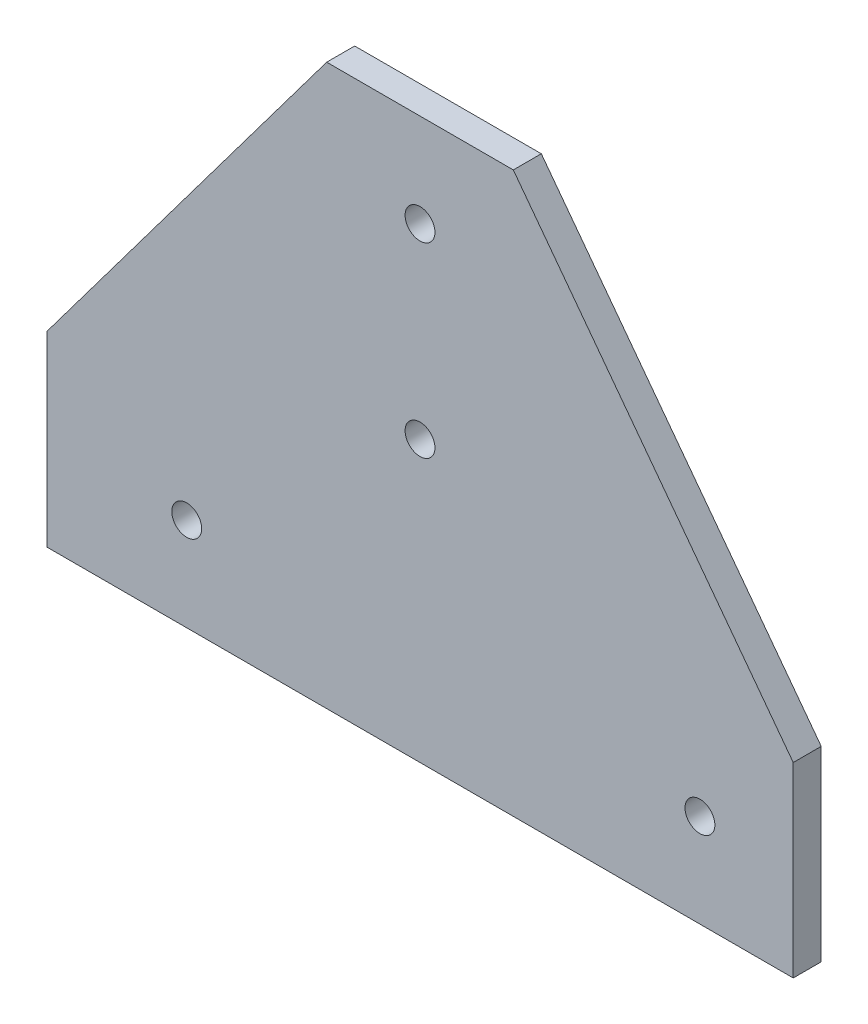
ISO-10303-21;
HEADER;
FILE_DESCRIPTION(('STEP AP214'),'2;1');
FILE_NAME('part.step','',(''),(''),'','','');
FILE_SCHEMA(('AUTOMOTIVE_DESIGN { 1 0 10303 214 1 1 1 1 }'));
ENDSEC;
DATA;
#1=APPLICATION_CONTEXT('core data for automotive mechanical design processes');
#2=APPLICATION_PROTOCOL_DEFINITION('international standard','automotive_design',2000,#1);
#3=PRODUCT_CONTEXT('',#1,'mechanical');
#4=PRODUCT('Part','Part','',(#3));
#5=PRODUCT_RELATED_PRODUCT_CATEGORY('part','',(#4));
#6=PRODUCT_DEFINITION_FORMATION('','',#4);
#7=PRODUCT_DEFINITION_CONTEXT('part definition',#1,'design');
#8=PRODUCT_DEFINITION('design','',#6,#7);
#9=PRODUCT_DEFINITION_SHAPE('','',#8);
#10=(LENGTH_UNIT() NAMED_UNIT(*) SI_UNIT(.MILLI.,.METRE.));
#11=(NAMED_UNIT(*) PLANE_ANGLE_UNIT() SI_UNIT($,.RADIAN.));
#12=(NAMED_UNIT(*) SI_UNIT($,.STERADIAN.) SOLID_ANGLE_UNIT());
#13=UNCERTAINTY_MEASURE_WITH_UNIT(LENGTH_MEASURE(1.E-05),#10,'distance_accuracy_value','');
#14=(GEOMETRIC_REPRESENTATION_CONTEXT(3) GLOBAL_UNCERTAINTY_ASSIGNED_CONTEXT((#13)) GLOBAL_UNIT_ASSIGNED_CONTEXT((#10,
#11,#12)) REPRESENTATION_CONTEXT('',''));
#15=CARTESIAN_POINT('',(0.,0.,0.));
#16=DIRECTION('',(0.,0.,1.));
#17=DIRECTION('',(1.,0.,0.));
#18=AXIS2_PLACEMENT_3D('',#15,#16,#17);
#19=CARTESIAN_POINT('',(0.,0.,3.));
#20=DIRECTION('',(0.,0.,1.));
#21=DIRECTION('',(1.,0.,0.));
#22=AXIS2_PLACEMENT_3D('',#19,#20,#21);
#23=PLANE('',#22);
#24=CARTESIAN_POINT('',(443.489921235063,10.,3.));
#25=DIRECTION('',(0.,0.,1.));
#26=DIRECTION('',(1.,0.,0.));
#27=AXIS2_PLACEMENT_3D('',#24,#25,#26);
#28=CIRCLE('',#27,1.59999999999996);
#29=CARTESIAN_POINT('',(445.089921235063,10.,3.));
#30=VERTEX_POINT('',#29);
#31=EDGE_CURVE('E191',#30,#30,#28,.T.);
#32=ORIENTED_EDGE('',*,*,#31,.F.);
#33=EDGE_LOOP('',(#32));
#34=FACE_BOUND('',#33,.T.);
#35=CARTESIAN_POINT('',(413.489921235063,50.,3.));
#36=DIRECTION('',(0.,0.,1.));
#37=DIRECTION('',(1.,0.,0.));
#38=AXIS2_PLACEMENT_3D('',#35,#36,#37);
#39=CIRCLE('',#38,1.59999999999996);
#40=CARTESIAN_POINT('',(415.089921235063,50.,3.));
#41=VERTEX_POINT('',#40);
#42=EDGE_CURVE('E124',#41,#41,#39,.T.);
#43=ORIENTED_EDGE('',*,*,#42,.F.);
#44=EDGE_LOOP('',(#43));
#45=FACE_BOUND('',#44,.T.);
#46=DIRECTION('',(1.,0.,0.));
#47=VECTOR('',#46,1.);
#48=CARTESIAN_POINT('',(373.489921235063,0.,3.));
#49=LINE('',#48,#47);
#50=CARTESIAN_POINT('',(373.489921235063,0.,3.));
#51=VERTEX_POINT('',#50);
#52=CARTESIAN_POINT('',(453.489921235063,0.,3.));
#53=VERTEX_POINT('',#52);
#54=EDGE_CURVE('E131',#51,#53,#49,.T.);
#55=ORIENTED_EDGE('',*,*,#54,.T.);
#56=DIRECTION('',(0.,1.,0.));
#57=VECTOR('',#56,1.);
#58=CARTESIAN_POINT('',(453.489921235063,0.,3.));
#59=LINE('',#58,#57);
#60=CARTESIAN_POINT('',(453.489921235063,20.,3.));
#61=VERTEX_POINT('',#60);
#62=EDGE_CURVE('E89',#53,#61,#59,.T.);
#63=ORIENTED_EDGE('',*,*,#62,.T.);
#64=DIRECTION('',(-0.599999999999999,0.800000000000001,0.));
#65=VECTOR('',#64,1.);
#66=CARTESIAN_POINT('',(453.489921235063,20.,3.));
#67=LINE('',#66,#65);
#68=CARTESIAN_POINT('',(423.489921235063,60.,3.));
#69=VERTEX_POINT('',#68);
#70=EDGE_CURVE('E102',#61,#69,#67,.T.);
#71=ORIENTED_EDGE('',*,*,#70,.T.);
#72=DIRECTION('',(-1.,0.,0.));
#73=VECTOR('',#72,1.);
#74=CARTESIAN_POINT('',(423.489921235063,60.,3.));
#75=LINE('',#74,#73);
#76=CARTESIAN_POINT('',(403.489921235063,60.,3.));
#77=VERTEX_POINT('',#76);
#78=EDGE_CURVE('E96',#69,#77,#75,.T.);
#79=ORIENTED_EDGE('',*,*,#78,.T.);
#80=DIRECTION('',(-0.6,-0.8,0.));
#81=VECTOR('',#80,1.);
#82=CARTESIAN_POINT('',(403.489921235063,60.,3.));
#83=LINE('',#82,#81);
#84=CARTESIAN_POINT('',(373.489921235063,20.,3.));
#85=VERTEX_POINT('',#84);
#86=EDGE_CURVE('E100',#77,#85,#83,.T.);
#87=ORIENTED_EDGE('',*,*,#86,.T.);
#88=DIRECTION('',(0.,-1.,0.));
#89=VECTOR('',#88,1.);
#90=CARTESIAN_POINT('',(373.489921235063,20.,3.));
#91=LINE('',#90,#89);
#92=EDGE_CURVE('E52',#85,#51,#91,.T.);
#93=ORIENTED_EDGE('',*,*,#92,.T.);
#94=EDGE_LOOP('',(#55,#63,#71,#79,#87,#93));
#95=FACE_BOUND('',#94,.T.);
#96=CARTESIAN_POINT('',(413.489921235063,30.,3.));
#97=DIRECTION('',(0.,0.,1.));
#98=DIRECTION('',(1.,0.,0.));
#99=AXIS2_PLACEMENT_3D('',#96,#97,#98);
#100=CIRCLE('',#99,1.59999999999996);
#101=CARTESIAN_POINT('',(415.089921235063,30.,3.));
#102=VERTEX_POINT('',#101);
#103=EDGE_CURVE('E197',#102,#102,#100,.T.);
#104=ORIENTED_EDGE('',*,*,#103,.F.);
#105=EDGE_LOOP('',(#104));
#106=FACE_BOUND('',#105,.T.);
#107=CARTESIAN_POINT('',(388.489921235063,9.99999999999999,3.));
#108=DIRECTION('',(0.,0.,1.));
#109=DIRECTION('',(1.,0.,0.));
#110=AXIS2_PLACEMENT_3D('',#107,#108,#109);
#111=CIRCLE('',#110,1.59999999999996);
#112=CARTESIAN_POINT('',(390.089921235063,9.99999999999999,3.));
#113=VERTEX_POINT('',#112);
#114=EDGE_CURVE('E182',#113,#113,#111,.T.);
#115=ORIENTED_EDGE('',*,*,#114,.F.);
#116=EDGE_LOOP('',(#115));
#117=FACE_BOUND('',#116,.T.);
#118=ADVANCED_FACE('F35',(#34,#45,#95,#106,#117),#23,.T.);
#119=CARTESIAN_POINT('',(0.,0.,0.));
#120=DIRECTION('',(0.,0.,1.));
#121=DIRECTION('',(1.,0.,0.));
#122=AXIS2_PLACEMENT_3D('',#119,#120,#121);
#123=PLANE('',#122);
#124=DIRECTION('',(1.,0.,0.));
#125=VECTOR('',#124,1.);
#126=CARTESIAN_POINT('',(373.489921235063,0.,0.));
#127=LINE('',#126,#125);
#128=CARTESIAN_POINT('',(373.489921235063,0.,0.));
#129=VERTEX_POINT('',#128);
#130=CARTESIAN_POINT('',(453.489921235063,0.,0.));
#131=VERTEX_POINT('',#130);
#132=EDGE_CURVE('E120',#129,#131,#127,.T.);
#133=ORIENTED_EDGE('',*,*,#132,.F.);
#134=DIRECTION('',(0.,-1.,0.));
#135=VECTOR('',#134,1.);
#136=CARTESIAN_POINT('',(373.489921235063,20.,0.));
#137=LINE('',#136,#135);
#138=CARTESIAN_POINT('',(373.489921235063,20.,0.));
#139=VERTEX_POINT('',#138);
#140=EDGE_CURVE('E81',#139,#129,#137,.T.);
#141=ORIENTED_EDGE('',*,*,#140,.F.);
#142=DIRECTION('',(-0.6,-0.8,0.));
#143=VECTOR('',#142,1.);
#144=CARTESIAN_POINT('',(403.489921235063,60.,0.));
#145=LINE('',#144,#143);
#146=CARTESIAN_POINT('',(403.489921235063,60.,0.));
#147=VERTEX_POINT('',#146);
#148=EDGE_CURVE('E75',#147,#139,#145,.T.);
#149=ORIENTED_EDGE('',*,*,#148,.F.);
#150=DIRECTION('',(-1.,0.,0.));
#151=VECTOR('',#150,1.);
#152=CARTESIAN_POINT('',(423.489921235063,60.,0.));
#153=LINE('',#152,#151);
#154=CARTESIAN_POINT('',(423.489921235063,60.,0.));
#155=VERTEX_POINT('',#154);
#156=EDGE_CURVE('E110',#155,#147,#153,.T.);
#157=ORIENTED_EDGE('',*,*,#156,.F.);
#158=DIRECTION('',(-0.599999999999999,0.800000000000001,0.));
#159=VECTOR('',#158,1.);
#160=CARTESIAN_POINT('',(453.489921235063,20.,0.));
#161=LINE('',#160,#159);
#162=CARTESIAN_POINT('',(453.489921235063,20.,0.));
#163=VERTEX_POINT('',#162);
#164=EDGE_CURVE('E126',#163,#155,#161,.T.);
#165=ORIENTED_EDGE('',*,*,#164,.F.);
#166=DIRECTION('',(0.,1.,0.));
#167=VECTOR('',#166,1.);
#168=CARTESIAN_POINT('',(453.489921235063,0.,0.));
#169=LINE('',#168,#167);
#170=EDGE_CURVE('E123',#131,#163,#169,.T.);
#171=ORIENTED_EDGE('',*,*,#170,.F.);
#172=EDGE_LOOP('',(#133,#141,#149,#157,#165,#171));
#173=FACE_BOUND('',#172,.T.);
#174=CARTESIAN_POINT('',(413.489921235063,50.,0.));
#175=DIRECTION('',(0.,0.,1.));
#176=DIRECTION('',(1.,0.,0.));
#177=AXIS2_PLACEMENT_3D('',#174,#175,#176);
#178=CIRCLE('',#177,1.59999999999996);
#179=CARTESIAN_POINT('',(415.089921235063,50.,0.));
#180=VERTEX_POINT('',#179);
#181=EDGE_CURVE('E200',#180,#180,#178,.T.);
#182=ORIENTED_EDGE('',*,*,#181,.T.);
#183=EDGE_LOOP('',(#182));
#184=FACE_BOUND('',#183,.T.);
#185=CARTESIAN_POINT('',(413.489921235063,30.,0.));
#186=DIRECTION('',(0.,0.,1.));
#187=DIRECTION('',(1.,0.,0.));
#188=AXIS2_PLACEMENT_3D('',#185,#186,#187);
#189=CIRCLE('',#188,1.59999999999996);
#190=CARTESIAN_POINT('',(415.089921235063,30.,0.));
#191=VERTEX_POINT('',#190);
#192=EDGE_CURVE('E194',#191,#191,#189,.T.);
#193=ORIENTED_EDGE('',*,*,#192,.T.);
#194=EDGE_LOOP('',(#193));
#195=FACE_BOUND('',#194,.T.);
#196=CARTESIAN_POINT('',(443.489921235063,10.,0.));
#197=DIRECTION('',(0.,0.,1.));
#198=DIRECTION('',(1.,0.,0.));
#199=AXIS2_PLACEMENT_3D('',#196,#197,#198);
#200=CIRCLE('',#199,1.59999999999996);
#201=CARTESIAN_POINT('',(445.089921235063,10.,0.));
#202=VERTEX_POINT('',#201);
#203=EDGE_CURVE('E188',#202,#202,#200,.T.);
#204=ORIENTED_EDGE('',*,*,#203,.T.);
#205=EDGE_LOOP('',(#204));
#206=FACE_BOUND('',#205,.T.);
#207=CARTESIAN_POINT('',(388.489921235063,9.99999999999999,0.));
#208=DIRECTION('',(0.,0.,1.));
#209=DIRECTION('',(1.,0.,0.));
#210=AXIS2_PLACEMENT_3D('',#207,#208,#209);
#211=CIRCLE('',#210,1.59999999999996);
#212=CARTESIAN_POINT('',(390.089921235063,9.99999999999999,0.));
#213=VERTEX_POINT('',#212);
#214=EDGE_CURVE('E185',#213,#213,#211,.T.);
#215=ORIENTED_EDGE('',*,*,#214,.T.);
#216=EDGE_LOOP('',(#215));
#217=FACE_BOUND('',#216,.T.);
#218=ADVANCED_FACE('F140',(#173,#184,#195,#206,#217),#123,.F.);
#219=CARTESIAN_POINT('',(373.489921235063,0.,3.));
#220=DIRECTION('',(0.,1.,0.));
#221=DIRECTION('',(-1.,0.,0.));
#222=AXIS2_PLACEMENT_3D('',#219,#220,#221);
#223=PLANE('',#222);
#224=ORIENTED_EDGE('',*,*,#132,.T.);
#225=DIRECTION('',(0.,0.,-1.));
#226=VECTOR('',#225,1.);
#227=CARTESIAN_POINT('',(453.489921235063,0.,3.));
#228=LINE('',#227,#226);
#229=EDGE_CURVE('E11',#53,#131,#228,.T.);
#230=ORIENTED_EDGE('',*,*,#229,.F.);
#231=ORIENTED_EDGE('',*,*,#54,.F.);
#232=DIRECTION('',(0.,0.,-1.));
#233=VECTOR('',#232,1.);
#234=CARTESIAN_POINT('',(373.489921235063,0.,3.));
#235=LINE('',#234,#233);
#236=EDGE_CURVE('E116',#51,#129,#235,.T.);
#237=ORIENTED_EDGE('',*,*,#236,.T.);
#238=EDGE_LOOP('',(#224,#230,#231,#237));
#239=FACE_BOUND('',#238,.T.);
#240=ADVANCED_FACE('F37',(#239),#223,.F.);
#241=CARTESIAN_POINT('',(453.489921235063,0.,3.));
#242=DIRECTION('',(-1.,0.,0.));
#243=DIRECTION('',(0.,0.,1.));
#244=AXIS2_PLACEMENT_3D('',#241,#242,#243);
#245=PLANE('',#244);
#246=ORIENTED_EDGE('',*,*,#170,.T.);
#247=DIRECTION('',(0.,0.,-1.));
#248=VECTOR('',#247,1.);
#249=CARTESIAN_POINT('',(453.489921235063,20.,3.));
#250=LINE('',#249,#248);
#251=EDGE_CURVE('E44',#61,#163,#250,.T.);
#252=ORIENTED_EDGE('',*,*,#251,.F.);
#253=ORIENTED_EDGE('',*,*,#62,.F.);
#254=ORIENTED_EDGE('',*,*,#229,.T.);
#255=EDGE_LOOP('',(#246,#252,#253,#254));
#256=FACE_BOUND('',#255,.T.);
#257=ADVANCED_FACE('F258',(#256),#245,.F.);
#258=CARTESIAN_POINT('',(453.489921235063,20.,3.));
#259=DIRECTION('',(-0.800000000000001,-0.599999999999999,0.));
#260=DIRECTION('',(0.599999999999999,-0.800000000000001,0.));
#261=AXIS2_PLACEMENT_3D('',#258,#259,#260);
#262=PLANE('',#261);
#263=ORIENTED_EDGE('',*,*,#164,.T.);
#264=DIRECTION('',(0.,0.,-1.));
#265=VECTOR('',#264,1.);
#266=CARTESIAN_POINT('',(423.489921235063,60.,3.));
#267=LINE('',#266,#265);
#268=EDGE_CURVE('E111',#69,#155,#267,.T.);
#269=ORIENTED_EDGE('',*,*,#268,.F.);
#270=ORIENTED_EDGE('',*,*,#70,.F.);
#271=ORIENTED_EDGE('',*,*,#251,.T.);
#272=EDGE_LOOP('',(#263,#269,#270,#271));
#273=FACE_BOUND('',#272,.T.);
#274=ADVANCED_FACE('F137',(#273),#262,.F.);
#275=CARTESIAN_POINT('',(423.489921235063,60.,3.));
#276=DIRECTION('',(0.,-1.,0.));
#277=DIRECTION('',(0.,0.,-1.));
#278=AXIS2_PLACEMENT_3D('',#275,#276,#277);
#279=PLANE('',#278);
#280=ORIENTED_EDGE('',*,*,#156,.T.);
#281=DIRECTION('',(0.,0.,-1.));
#282=VECTOR('',#281,1.);
#283=CARTESIAN_POINT('',(403.489921235063,60.,3.));
#284=LINE('',#283,#282);
#285=EDGE_CURVE('E107',#77,#147,#284,.T.);
#286=ORIENTED_EDGE('',*,*,#285,.F.);
#287=ORIENTED_EDGE('',*,*,#78,.F.);
#288=ORIENTED_EDGE('',*,*,#268,.T.);
#289=EDGE_LOOP('',(#280,#286,#287,#288));
#290=FACE_BOUND('',#289,.T.);
#291=ADVANCED_FACE('F108',(#290),#279,.F.);
#292=CARTESIAN_POINT('',(403.489921235063,60.,3.));
#293=DIRECTION('',(0.8,-0.6,0.));
#294=DIRECTION('',(0.6,0.8,0.));
#295=AXIS2_PLACEMENT_3D('',#292,#293,#294);
#296=PLANE('',#295);
#297=ORIENTED_EDGE('',*,*,#148,.T.);
#298=DIRECTION('',(0.,0.,-1.));
#299=VECTOR('',#298,1.);
#300=CARTESIAN_POINT('',(373.489921235063,20.,3.));
#301=LINE('',#300,#299);
#302=EDGE_CURVE('E112',#85,#139,#301,.T.);
#303=ORIENTED_EDGE('',*,*,#302,.F.);
#304=ORIENTED_EDGE('',*,*,#86,.F.);
#305=ORIENTED_EDGE('',*,*,#285,.T.);
#306=EDGE_LOOP('',(#297,#303,#304,#305));
#307=FACE_BOUND('',#306,.T.);
#308=ADVANCED_FACE('F114',(#307),#296,.F.);
#309=CARTESIAN_POINT('',(373.489921235063,20.,3.));
#310=DIRECTION('',(1.,0.,0.));
#311=DIRECTION('',(0.,0.,-1.));
#312=AXIS2_PLACEMENT_3D('',#309,#310,#311);
#313=PLANE('',#312);
#314=ORIENTED_EDGE('',*,*,#140,.T.);
#315=ORIENTED_EDGE('',*,*,#236,.F.);
#316=ORIENTED_EDGE('',*,*,#92,.F.);
#317=ORIENTED_EDGE('',*,*,#302,.T.);
#318=EDGE_LOOP('',(#314,#315,#316,#317));
#319=FACE_BOUND('',#318,.T.);
#320=ADVANCED_FACE('F145',(#319),#313,.F.);
#321=CARTESIAN_POINT('',(413.489921235063,50.,3.));
#322=DIRECTION('',(0.,0.,-1.));
#323=DIRECTION('',(-1.,0.,0.));
#324=AXIS2_PLACEMENT_3D('',#321,#322,#323);
#325=CYLINDRICAL_SURFACE('',#324,1.59999999999996);
#326=ORIENTED_EDGE('',*,*,#42,.T.);
#327=EDGE_LOOP('',(#326));
#328=FACE_BOUND('',#327,.T.);
#329=ORIENTED_EDGE('',*,*,#181,.F.);
#330=EDGE_LOOP('',(#329));
#331=FACE_BOUND('',#330,.T.);
#332=ADVANCED_FACE('F147',(#328,#331),#325,.F.);
#333=CARTESIAN_POINT('',(413.489921235063,30.,3.));
#334=DIRECTION('',(0.,0.,-1.));
#335=DIRECTION('',(-1.,0.,0.));
#336=AXIS2_PLACEMENT_3D('',#333,#334,#335);
#337=CYLINDRICAL_SURFACE('',#336,1.59999999999996);
#338=ORIENTED_EDGE('',*,*,#103,.T.);
#339=EDGE_LOOP('',(#338));
#340=FACE_BOUND('',#339,.T.);
#341=ORIENTED_EDGE('',*,*,#192,.F.);
#342=EDGE_LOOP('',(#341));
#343=FACE_BOUND('',#342,.T.);
#344=ADVANCED_FACE('F153',(#340,#343),#337,.F.);
#345=CARTESIAN_POINT('',(443.489921235063,10.,3.));
#346=DIRECTION('',(0.,0.,-1.));
#347=DIRECTION('',(-1.,0.,0.));
#348=AXIS2_PLACEMENT_3D('',#345,#346,#347);
#349=CYLINDRICAL_SURFACE('',#348,1.59999999999996);
#350=ORIENTED_EDGE('',*,*,#31,.T.);
#351=EDGE_LOOP('',(#350));
#352=FACE_BOUND('',#351,.T.);
#353=ORIENTED_EDGE('',*,*,#203,.F.);
#354=EDGE_LOOP('',(#353));
#355=FACE_BOUND('',#354,.T.);
#356=ADVANCED_FACE('F169',(#352,#355),#349,.F.);
#357=CARTESIAN_POINT('',(388.489921235063,9.99999999999999,3.));
#358=DIRECTION('',(0.,0.,-1.));
#359=DIRECTION('',(-1.,0.,0.));
#360=AXIS2_PLACEMENT_3D('',#357,#358,#359);
#361=CYLINDRICAL_SURFACE('',#360,1.59999999999996);
#362=ORIENTED_EDGE('',*,*,#114,.T.);
#363=EDGE_LOOP('',(#362));
#364=FACE_BOUND('',#363,.T.);
#365=ORIENTED_EDGE('',*,*,#214,.F.);
#366=EDGE_LOOP('',(#365));
#367=FACE_BOUND('',#366,.T.);
#368=ADVANCED_FACE('F173',(#364,#367),#361,.F.);
#369=CLOSED_SHELL('',(#118,#218,#240,#257,#274,#291,#308,#320,#332,#344,#356,#368));
#370=MANIFOLD_SOLID_BREP('B2',#369);
#371=ADVANCED_BREP_SHAPE_REPRESENTATION('',(#18,#370),#14);
#372=SHAPE_DEFINITION_REPRESENTATION(#9,#371);
ENDSEC;
END-ISO-10303-21;
